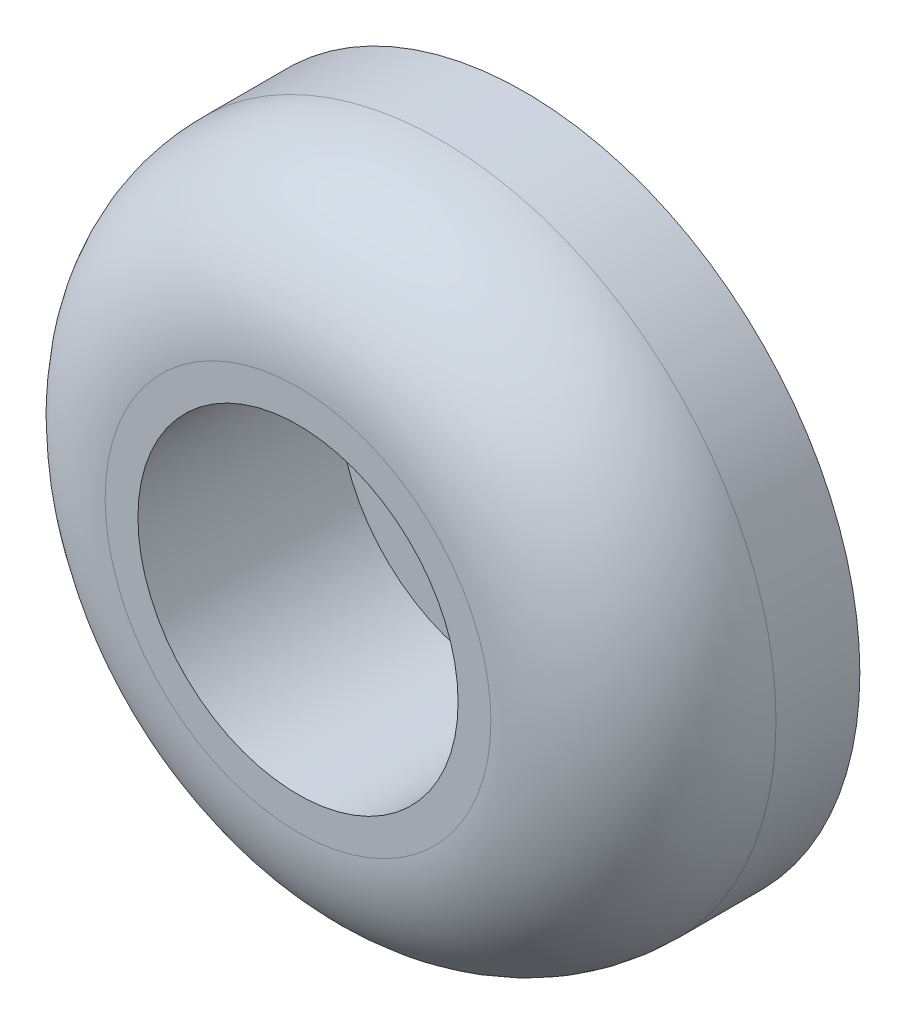
ISO-10303-21;
HEADER;
FILE_DESCRIPTION(('STEP AP214'),'2;1');
FILE_NAME('part.step','',(''),(''),'','','');
FILE_SCHEMA(('AUTOMOTIVE_DESIGN { 1 0 10303 214 1 1 1 1 }'));
ENDSEC;
DATA;
#1=APPLICATION_CONTEXT('core data for automotive mechanical design processes');
#2=APPLICATION_PROTOCOL_DEFINITION('international standard','automotive_design',2000,#1);
#3=PRODUCT_CONTEXT('',#1,'mechanical');
#4=PRODUCT('Part','Part','',(#3));
#5=PRODUCT_RELATED_PRODUCT_CATEGORY('part','',(#4));
#6=PRODUCT_DEFINITION_FORMATION('','',#4);
#7=PRODUCT_DEFINITION_CONTEXT('part definition',#1,'design');
#8=PRODUCT_DEFINITION('design','',#6,#7);
#9=PRODUCT_DEFINITION_SHAPE('','',#8);
#10=(LENGTH_UNIT() NAMED_UNIT(*) SI_UNIT(.MILLI.,.METRE.));
#11=(NAMED_UNIT(*) PLANE_ANGLE_UNIT() SI_UNIT($,.RADIAN.));
#12=(NAMED_UNIT(*) SI_UNIT($,.STERADIAN.) SOLID_ANGLE_UNIT());
#13=UNCERTAINTY_MEASURE_WITH_UNIT(LENGTH_MEASURE(1.E-05),#10,'distance_accuracy_value','');
#14=(GEOMETRIC_REPRESENTATION_CONTEXT(3) GLOBAL_UNCERTAINTY_ASSIGNED_CONTEXT((#13)) GLOBAL_UNIT_ASSIGNED_CONTEXT((#10,
#11,#12)) REPRESENTATION_CONTEXT('',''));
#15=CARTESIAN_POINT('',(0.,0.,0.));
#16=DIRECTION('',(0.,0.,1.));
#17=DIRECTION('',(1.,0.,0.));
#18=AXIS2_PLACEMENT_3D('',#15,#16,#17);
#19=CARTESIAN_POINT('',(0.,0.,0.750000000000001));
#20=DIRECTION('',(0.,0.,-1.));
#21=DIRECTION('',(-1.,0.,0.));
#22=AXIS2_PLACEMENT_3D('',#19,#20,#21);
#23=CYLINDRICAL_SURFACE('',#22,2.5);
#24=CARTESIAN_POINT('',(0.,0.,0.750000000000001));
#25=DIRECTION('',(0.,0.,-1.));
#26=DIRECTION('',(-1.,0.,0.));
#27=AXIS2_PLACEMENT_3D('',#24,#25,#26);
#28=CIRCLE('',#27,2.5);
#29=CARTESIAN_POINT('',(-2.5,0.,0.750000000000001));
#30=VERTEX_POINT('',#29);
#31=EDGE_CURVE('E143',#30,#30,#28,.T.);
#32=ORIENTED_EDGE('',*,*,#31,.F.);
#33=EDGE_LOOP('',(#32));
#34=FACE_BOUND('',#33,.T.);
#35=CARTESIAN_POINT('',(0.,0.,0.));
#36=DIRECTION('',(0.,0.,-1.));
#37=DIRECTION('',(-1.,0.,0.));
#38=AXIS2_PLACEMENT_3D('',#35,#36,#37);
#39=CIRCLE('',#38,2.5);
#40=CARTESIAN_POINT('',(-2.5,0.,0.));
#41=VERTEX_POINT('',#40);
#42=EDGE_CURVE('E149',#41,#41,#39,.T.);
#43=ORIENTED_EDGE('',*,*,#42,.T.);
#44=EDGE_LOOP('',(#43));
#45=FACE_BOUND('',#44,.T.);
#46=ADVANCED_FACE('F15',(#34,#45),#23,.F.);
#47=CARTESIAN_POINT('',(0.,0.,0.750000000000001));
#48=DIRECTION('',(0.,0.,1.));
#49=DIRECTION('',(1.,0.,0.));
#50=AXIS2_PLACEMENT_3D('',#47,#48,#49);
#51=PLANE('',#50);
#52=ORIENTED_EDGE('',*,*,#31,.T.);
#53=EDGE_LOOP('',(#52));
#54=FACE_BOUND('',#53,.T.);
#55=CARTESIAN_POINT('',(0.,0.,0.75));
#56=DIRECTION('',(0.,0.,-1.));
#57=DIRECTION('',(-1.,0.,0.));
#58=AXIS2_PLACEMENT_3D('',#55,#56,#57);
#59=CIRCLE('',#58,4.77285888461259);
#60=CARTESIAN_POINT('',(-4.77285888461259,0.,0.75));
#61=VERTEX_POINT('',#60);
#62=EDGE_CURVE('E146',#61,#61,#59,.F.);
#63=ORIENTED_EDGE('',*,*,#62,.T.);
#64=EDGE_LOOP('',(#63));
#65=FACE_BOUND('',#64,.T.);
#66=ADVANCED_FACE('F73',(#54,#65),#51,.T.);
#67=CARTESIAN_POINT('',(0.,0.,0.));
#68=DIRECTION('',(0.,0.,1.));
#69=DIRECTION('',(1.,0.,0.));
#70=AXIS2_PLACEMENT_3D('',#67,#68,#69);
#71=PLANE('',#70);
#72=ORIENTED_EDGE('',*,*,#42,.F.);
#73=EDGE_LOOP('',(#72));
#74=FACE_BOUND('',#73,.T.);
#75=CARTESIAN_POINT('',(0.,0.,0.));
#76=DIRECTION('',(0.,0.,1.));
#77=DIRECTION('',(1.,0.,0.));
#78=AXIS2_PLACEMENT_3D('',#75,#76,#77);
#79=CIRCLE('',#78,10.);
#80=CARTESIAN_POINT('',(10.,0.,0.));
#81=VERTEX_POINT('',#80);
#82=EDGE_CURVE('E37',#81,#81,#79,.T.);
#83=ORIENTED_EDGE('',*,*,#82,.F.);
#84=EDGE_LOOP('',(#83));
#85=FACE_BOUND('',#84,.T.);
#86=ADVANCED_FACE('F70',(#74,#85),#71,.F.);
#87=CARTESIAN_POINT('',(0.,0.,6.75));
#88=DIRECTION('',(0.,0.,-1.));
#89=DIRECTION('',(-1.,0.,0.));
#90=AXIS2_PLACEMENT_3D('',#87,#88,#89);
#91=CYLINDRICAL_SURFACE('',#90,4.77285888461259);
#92=CARTESIAN_POINT('',(0.,0.,6.75));
#93=DIRECTION('',(0.,0.,-1.));
#94=DIRECTION('',(-1.,0.,0.));
#95=AXIS2_PLACEMENT_3D('',#92,#93,#94);
#96=CIRCLE('',#95,4.77285888461259);
#97=CARTESIAN_POINT('',(-4.77285888461259,0.,6.75));
#98=VERTEX_POINT('',#97);
#99=EDGE_CURVE('E31',#98,#98,#96,.T.);
#100=ORIENTED_EDGE('',*,*,#99,.F.);
#101=EDGE_LOOP('',(#100));
#102=FACE_BOUND('',#101,.T.);
#103=ORIENTED_EDGE('',*,*,#62,.F.);
#104=EDGE_LOOP('',(#103));
#105=FACE_BOUND('',#104,.T.);
#106=ADVANCED_FACE('F66',(#102,#105),#91,.F.);
#107=CARTESIAN_POINT('',(0.,0.,0.));
#108=DIRECTION('',(0.,0.,1.));
#109=DIRECTION('',(1.,0.,0.));
#110=AXIS2_PLACEMENT_3D('',#107,#108,#109);
#111=CYLINDRICAL_SURFACE('',#110,10.);
#112=CARTESIAN_POINT('',(0.,0.,2.5));
#113=DIRECTION('',(0.,0.,1.));
#114=DIRECTION('',(1.,0.,0.));
#115=AXIS2_PLACEMENT_3D('',#112,#113,#114);
#116=CIRCLE('',#115,10.);
#117=CARTESIAN_POINT('',(10.,0.,2.5));
#118=VERTEX_POINT('',#117);
#119=EDGE_CURVE('E23',#118,#118,#116,.T.);
#120=ORIENTED_EDGE('',*,*,#119,.F.);
#121=EDGE_LOOP('',(#120));
#122=FACE_BOUND('',#121,.T.);
#123=ORIENTED_EDGE('',*,*,#82,.T.);
#124=EDGE_LOOP('',(#123));
#125=FACE_BOUND('',#124,.T.);
#126=ADVANCED_FACE('F61',(#122,#125),#111,.T.);
#127=CARTESIAN_POINT('',(0.,0.,6.75));
#128=DIRECTION('',(0.,0.,1.));
#129=DIRECTION('',(1.,0.,0.));
#130=AXIS2_PLACEMENT_3D('',#127,#128,#129);
#131=PLANE('',#130);
#132=ORIENTED_EDGE('',*,*,#99,.T.);
#133=EDGE_LOOP('',(#132));
#134=FACE_BOUND('',#133,.T.);
#135=CARTESIAN_POINT('',(0.,0.,6.75));
#136=DIRECTION('',(0.,0.,-1.));
#137=DIRECTION('',(1.,0.,0.));
#138=AXIS2_PLACEMENT_3D('',#135,#136,#137);
#139=CIRCLE('',#138,5.75);
#140=CARTESIAN_POINT('',(5.75,0.,6.75));
#141=VERTEX_POINT('',#140);
#142=EDGE_CURVE('E10',#141,#141,#139,.T.);
#143=ORIENTED_EDGE('',*,*,#142,.F.);
#144=EDGE_LOOP('',(#143));
#145=FACE_BOUND('',#144,.T.);
#146=ADVANCED_FACE('F50',(#134,#145),#131,.T.);
#147=CARTESIAN_POINT('',(0.,0.,2.5));
#148=DIRECTION('',(0.,0.,1.));
#149=DIRECTION('',(1.,0.,0.));
#150=AXIS2_PLACEMENT_3D('',#147,#148,#149);
#151=TOROIDAL_SURFACE('',#150,5.75,4.25);
#152=ORIENTED_EDGE('',*,*,#142,.T.);
#153=EDGE_LOOP('',(#152));
#154=FACE_BOUND('',#153,.T.);
#155=ORIENTED_EDGE('',*,*,#119,.T.);
#156=EDGE_LOOP('',(#155));
#157=FACE_BOUND('',#156,.T.);
#158=ADVANCED_FACE('F60',(#154,#157),#151,.T.);
#159=CLOSED_SHELL('',(#46,#66,#86,#106,#126,#146,#158));
#160=MANIFOLD_SOLID_BREP('B1',#159);
#161=ADVANCED_BREP_SHAPE_REPRESENTATION('',(#18,#160),#14);
#162=SHAPE_DEFINITION_REPRESENTATION(#9,#161);
ENDSEC;
END-ISO-10303-21;
